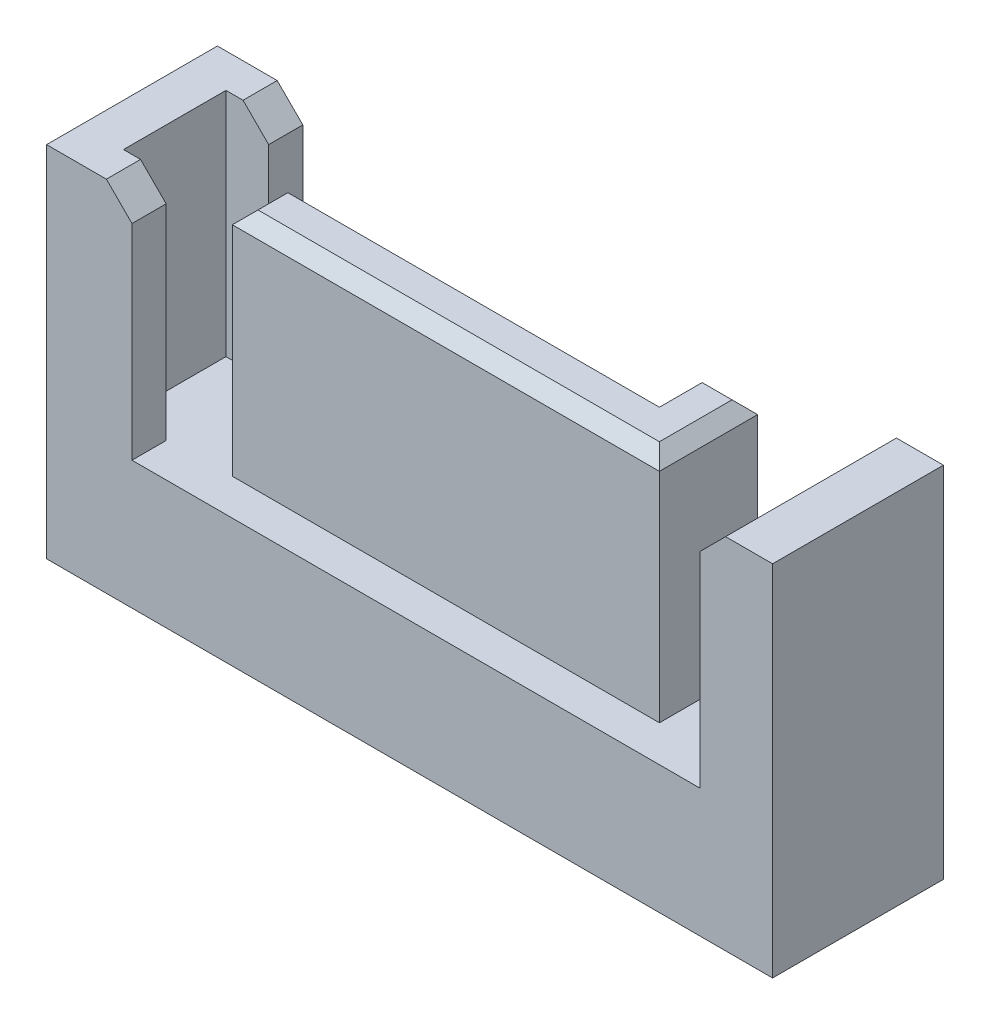
ISO-10303-21;
HEADER;
FILE_DESCRIPTION(('STEP AP214'),'2;1');
FILE_NAME('part.step','',(''),(''),'','','');
FILE_SCHEMA(('AUTOMOTIVE_DESIGN { 1 0 10303 214 1 1 1 1 }'));
ENDSEC;
DATA;
#1=APPLICATION_CONTEXT('core data for automotive mechanical design processes');
#2=APPLICATION_PROTOCOL_DEFINITION('international standard','automotive_design',2000,#1);
#3=PRODUCT_CONTEXT('',#1,'mechanical');
#4=PRODUCT('Part','Part','',(#3));
#5=PRODUCT_RELATED_PRODUCT_CATEGORY('part','',(#4));
#6=PRODUCT_DEFINITION_FORMATION('','',#4);
#7=PRODUCT_DEFINITION_CONTEXT('part definition',#1,'design');
#8=PRODUCT_DEFINITION('design','',#6,#7);
#9=PRODUCT_DEFINITION_SHAPE('','',#8);
#10=(LENGTH_UNIT() NAMED_UNIT(*) SI_UNIT(.MILLI.,.METRE.));
#11=(NAMED_UNIT(*) PLANE_ANGLE_UNIT() SI_UNIT($,.RADIAN.));
#12=(NAMED_UNIT(*) SI_UNIT($,.STERADIAN.) SOLID_ANGLE_UNIT());
#13=UNCERTAINTY_MEASURE_WITH_UNIT(LENGTH_MEASURE(1.E-05),#10,'distance_accuracy_value','');
#14=(GEOMETRIC_REPRESENTATION_CONTEXT(3) GLOBAL_UNCERTAINTY_ASSIGNED_CONTEXT((#13)) GLOBAL_UNIT_ASSIGNED_CONTEXT((#10,
#11,#12)) REPRESENTATION_CONTEXT('',''));
#15=CARTESIAN_POINT('',(0.,0.,0.));
#16=DIRECTION('',(0.,0.,1.));
#17=DIRECTION('',(1.,0.,0.));
#18=AXIS2_PLACEMENT_3D('',#15,#16,#17);
#19=CARTESIAN_POINT('',(6.8,3.,2.));
#20=DIRECTION('',(0.,-1.,0.));
#21=DIRECTION('',(0.,0.,-1.));
#22=AXIS2_PLACEMENT_3D('',#19,#20,#21);
#23=PLANE('',#22);
#24=DIRECTION('',(0.,0.,-1.));
#25=VECTOR('',#24,1.);
#26=CARTESIAN_POINT('',(6.8,3.,-2.));
#27=LINE('',#26,#25);
#28=CARTESIAN_POINT('',(6.8,3.,2.));
#29=VERTEX_POINT('',#28);
#30=CARTESIAN_POINT('',(6.8,3.,-2.));
#31=VERTEX_POINT('',#30);
#32=EDGE_CURVE('E238',#29,#31,#27,.T.);
#33=ORIENTED_EDGE('',*,*,#32,.T.);
#34=DIRECTION('',(-1.,0.,0.));
#35=VECTOR('',#34,1.);
#36=CARTESIAN_POINT('',(6.8,3.,-2.));
#37=LINE('',#36,#35);
#38=CARTESIAN_POINT('',(-6.5,3.,-2.));
#39=VERTEX_POINT('',#38);
#40=EDGE_CURVE('E241',#31,#39,#37,.T.);
#41=ORIENTED_EDGE('',*,*,#40,.T.);
#42=DIRECTION('',(0.,0.,1.));
#43=VECTOR('',#42,1.);
#44=CARTESIAN_POINT('',(-6.5,3.,-2.));
#45=LINE('',#44,#43);
#46=CARTESIAN_POINT('',(-6.5,3.,-1.2));
#47=VERTEX_POINT('',#46);
#48=EDGE_CURVE('E245',#39,#47,#45,.T.);
#49=ORIENTED_EDGE('',*,*,#48,.T.);
#50=DIRECTION('',(-1.,0.,0.));
#51=VECTOR('',#50,1.);
#52=CARTESIAN_POINT('',(-6.5,3.,-1.2));
#53=LINE('',#52,#51);
#54=CARTESIAN_POINT('',(-7.5,3.,-1.2));
#55=VERTEX_POINT('',#54);
#56=EDGE_CURVE('E248',#47,#55,#53,.T.);
#57=ORIENTED_EDGE('',*,*,#56,.T.);
#58=DIRECTION('',(0.,0.,1.));
#59=VECTOR('',#58,1.);
#60=CARTESIAN_POINT('',(-7.5,3.,-1.2));
#61=LINE('',#60,#59);
#62=CARTESIAN_POINT('',(-7.5,3.,1.2));
#63=VERTEX_POINT('',#62);
#64=EDGE_CURVE('E251',#55,#63,#61,.T.);
#65=ORIENTED_EDGE('',*,*,#64,.T.);
#66=DIRECTION('',(1.,0.,0.));
#67=VECTOR('',#66,1.);
#68=CARTESIAN_POINT('',(-6.5,3.,1.2));
#69=LINE('',#68,#67);
#70=CARTESIAN_POINT('',(-6.5,3.,1.2));
#71=VERTEX_POINT('',#70);
#72=EDGE_CURVE('E254',#63,#71,#69,.T.);
#73=ORIENTED_EDGE('',*,*,#72,.T.);
#74=DIRECTION('',(0.,0.,1.));
#75=VECTOR('',#74,1.);
#76=CARTESIAN_POINT('',(-6.5,3.,1.2));
#77=LINE('',#76,#75);
#78=CARTESIAN_POINT('',(-6.5,3.,2.));
#79=VERTEX_POINT('',#78);
#80=EDGE_CURVE('E257',#71,#79,#77,.T.);
#81=ORIENTED_EDGE('',*,*,#80,.T.);
#82=DIRECTION('',(1.,0.,0.));
#83=VECTOR('',#82,1.);
#84=CARTESIAN_POINT('',(6.8,3.,2.));
#85=LINE('',#84,#83);
#86=EDGE_CURVE('E260',#79,#29,#85,.T.);
#87=ORIENTED_EDGE('',*,*,#86,.T.);
#88=EDGE_LOOP('',(#33,#41,#49,#57,#65,#73,#81,#87));
#89=FACE_BOUND('',#88,.T.);
#90=DIRECTION('',(-1.,0.,0.));
#91=VECTOR('',#90,1.);
#92=CARTESIAN_POINT('',(3.7,3.,-1.15));
#93=LINE('',#92,#91);
#94=CARTESIAN_POINT('',(5.,3.,-1.15));
#95=VERTEX_POINT('',#94);
#96=CARTESIAN_POINT('',(3.7,3.,-1.15));
#97=VERTEX_POINT('',#96);
#98=EDGE_CURVE('E202',#95,#97,#93,.T.);
#99=ORIENTED_EDGE('',*,*,#98,.F.);
#100=DIRECTION('',(0.,0.,-1.));
#101=VECTOR('',#100,1.);
#102=CARTESIAN_POINT('',(5.,3.,-1.15));
#103=LINE('',#102,#101);
#104=CARTESIAN_POINT('',(5.,3.,1.15));
#105=VERTEX_POINT('',#104);
#106=EDGE_CURVE('E210',#105,#95,#103,.T.);
#107=ORIENTED_EDGE('',*,*,#106,.F.);
#108=DIRECTION('',(1.,0.,0.));
#109=VECTOR('',#108,1.);
#110=CARTESIAN_POINT('',(5.,3.,1.15));
#111=LINE('',#110,#109);
#112=CARTESIAN_POINT('',(-5.,3.,1.15));
#113=VERTEX_POINT('',#112);
#114=EDGE_CURVE('E222',#113,#105,#111,.T.);
#115=ORIENTED_EDGE('',*,*,#114,.F.);
#116=DIRECTION('',(0.,0.,1.));
#117=VECTOR('',#116,1.);
#118=CARTESIAN_POINT('',(-5.,3.,1.15));
#119=LINE('',#118,#117);
#120=CARTESIAN_POINT('',(-5.,3.,-0.15));
#121=VERTEX_POINT('',#120);
#122=EDGE_CURVE('E224',#121,#113,#119,.T.);
#123=ORIENTED_EDGE('',*,*,#122,.F.);
#124=DIRECTION('',(-1.,0.,0.));
#125=VECTOR('',#124,1.);
#126=CARTESIAN_POINT('',(-5.,3.,-0.15));
#127=LINE('',#126,#125);
#128=CARTESIAN_POINT('',(3.7,3.,-0.150000000000001));
#129=VERTEX_POINT('',#128);
#130=EDGE_CURVE('E404',#129,#121,#127,.T.);
#131=ORIENTED_EDGE('',*,*,#130,.F.);
#132=DIRECTION('',(0.,0.,1.));
#133=VECTOR('',#132,1.);
#134=CARTESIAN_POINT('',(3.7,3.,-0.150000000000001));
#135=LINE('',#134,#133);
#136=EDGE_CURVE('E219',#97,#129,#135,.T.);
#137=ORIENTED_EDGE('',*,*,#136,.F.);
#138=EDGE_LOOP('',(#99,#107,#115,#123,#131,#137));
#139=FACE_BOUND('',#138,.T.);
#140=ADVANCED_FACE('F37',(#89,#139),#23,.F.);
#141=CARTESIAN_POINT('',(-8.5,8.4,2.));
#142=DIRECTION('',(0.,1.,0.));
#143=DIRECTION('',(0.,0.,1.));
#144=AXIS2_PLACEMENT_3D('',#141,#142,#143);
#145=PLANE('',#144);
#146=DIRECTION('',(-1.,0.,0.));
#147=VECTOR('',#146,1.);
#148=CARTESIAN_POINT('',(-8.5,8.4,-2.));
#149=LINE('',#148,#147);
#150=CARTESIAN_POINT('',(8.5,8.4,-2.));
#151=VERTEX_POINT('',#150);
#152=CARTESIAN_POINT('',(7.4,8.4,-2.));
#153=VERTEX_POINT('',#152);
#154=EDGE_CURVE('E304',#151,#153,#149,.T.);
#155=ORIENTED_EDGE('',*,*,#154,.T.);
#156=DIRECTION('',(0.,0.,1.));
#157=VECTOR('',#156,1.);
#158=CARTESIAN_POINT('',(7.4,8.4,2.));
#159=LINE('',#158,#157);
#160=CARTESIAN_POINT('',(7.4,8.4,2.));
#161=VERTEX_POINT('',#160);
#162=EDGE_CURVE('E351',#153,#161,#159,.T.);
#163=ORIENTED_EDGE('',*,*,#162,.T.);
#164=DIRECTION('',(1.,0.,0.));
#165=VECTOR('',#164,1.);
#166=CARTESIAN_POINT('',(-8.5,8.4,2.));
#167=LINE('',#166,#165);
#168=CARTESIAN_POINT('',(8.5,8.4,2.));
#169=VERTEX_POINT('',#168);
#170=EDGE_CURVE('E296',#161,#169,#167,.T.);
#171=ORIENTED_EDGE('',*,*,#170,.T.);
#172=DIRECTION('',(0.,0.,-1.));
#173=VECTOR('',#172,1.);
#174=CARTESIAN_POINT('',(8.5,8.4,-2.));
#175=LINE('',#174,#173);
#176=EDGE_CURVE('E301',#169,#151,#175,.T.);
#177=ORIENTED_EDGE('',*,*,#176,.T.);
#178=EDGE_LOOP('',(#155,#163,#171,#177));
#179=FACE_BOUND('',#178,.T.);
#180=ADVANCED_FACE('F421',(#179),#145,.T.);
#181=CARTESIAN_POINT('',(-8.5,8.4,-2.));
#182=DIRECTION('',(1.,0.,0.));
#183=DIRECTION('',(0.,0.,-1.));
#184=AXIS2_PLACEMENT_3D('',#181,#182,#183);
#185=PLANE('',#184);
#186=DIRECTION('',(0.,0.,1.));
#187=VECTOR('',#186,1.);
#188=CARTESIAN_POINT('',(-8.5,0.,-2.));
#189=LINE('',#188,#187);
#190=CARTESIAN_POINT('',(-8.5,0.,-2.));
#191=VERTEX_POINT('',#190);
#192=CARTESIAN_POINT('',(-8.5,0.,2.));
#193=VERTEX_POINT('',#192);
#194=EDGE_CURVE('E273',#191,#193,#189,.T.);
#195=ORIENTED_EDGE('',*,*,#194,.T.);
#196=DIRECTION('',(0.,-1.,0.));
#197=VECTOR('',#196,1.);
#198=CARTESIAN_POINT('',(-8.5,8.4,2.));
#199=LINE('',#198,#197);
#200=CARTESIAN_POINT('',(-8.5,8.4,2.));
#201=VERTEX_POINT('',#200);
#202=EDGE_CURVE('E323',#201,#193,#199,.T.);
#203=ORIENTED_EDGE('',*,*,#202,.F.);
#204=DIRECTION('',(0.,0.,1.));
#205=VECTOR('',#204,1.);
#206=CARTESIAN_POINT('',(-8.5,8.4,-2.));
#207=LINE('',#206,#205);
#208=CARTESIAN_POINT('',(-8.5,8.4,-2.));
#209=VERTEX_POINT('',#208);
#210=EDGE_CURVE('E293',#209,#201,#207,.T.);
#211=ORIENTED_EDGE('',*,*,#210,.F.);
#212=DIRECTION('',(0.,-1.,0.));
#213=VECTOR('',#212,1.);
#214=CARTESIAN_POINT('',(-8.5,8.4,-2.));
#215=LINE('',#214,#213);
#216=EDGE_CURVE('E307',#209,#191,#215,.T.);
#217=ORIENTED_EDGE('',*,*,#216,.T.);
#218=EDGE_LOOP('',(#195,#203,#211,#217));
#219=FACE_BOUND('',#218,.T.);
#220=ADVANCED_FACE('F427',(#219),#185,.F.);
#221=CARTESIAN_POINT('',(-8.5,8.4,2.));
#222=DIRECTION('',(0.,0.,-1.));
#223=DIRECTION('',(-1.,0.,0.));
#224=AXIS2_PLACEMENT_3D('',#221,#222,#223);
#225=PLANE('',#224);
#226=DIRECTION('',(0.,1.,0.));
#227=VECTOR('',#226,1.);
#228=CARTESIAN_POINT('',(-6.5,3.,2.));
#229=LINE('',#228,#227);
#230=CARTESIAN_POINT('',(-6.5,7.8,2.));
#231=VERTEX_POINT('',#230);
#232=EDGE_CURVE('E274',#79,#231,#229,.T.);
#233=ORIENTED_EDGE('',*,*,#232,.T.);
#234=DIRECTION('',(-0.707106781186549,0.707106781186547,0.));
#235=VECTOR('',#234,1.);
#236=CARTESIAN_POINT('',(-6.5,7.8,2.));
#237=LINE('',#236,#235);
#238=CARTESIAN_POINT('',(-7.10000000000001,8.4,2.));
#239=VERTEX_POINT('',#238);
#240=EDGE_CURVE('E331',#231,#239,#237,.T.);
#241=ORIENTED_EDGE('',*,*,#240,.T.);
#242=EDGE_CURVE('E298',#201,#239,#167,.T.);
#243=ORIENTED_EDGE('',*,*,#242,.F.);
#244=ORIENTED_EDGE('',*,*,#202,.T.);
#245=DIRECTION('',(1.,0.,0.));
#246=VECTOR('',#245,1.);
#247=CARTESIAN_POINT('',(-8.5,0.,2.));
#248=LINE('',#247,#246);
#249=CARTESIAN_POINT('',(8.5,0.,2.));
#250=VERTEX_POINT('',#249);
#251=EDGE_CURVE('E310',#193,#250,#248,.T.);
#252=ORIENTED_EDGE('',*,*,#251,.T.);
#253=DIRECTION('',(0.,-1.,0.));
#254=VECTOR('',#253,1.);
#255=CARTESIAN_POINT('',(8.5,8.4,2.));
#256=LINE('',#255,#254);
#257=EDGE_CURVE('E320',#169,#250,#256,.T.);
#258=ORIENTED_EDGE('',*,*,#257,.F.);
#259=ORIENTED_EDGE('',*,*,#170,.F.);
#260=DIRECTION('',(-0.707106781186549,-0.707106781186547,0.));
#261=VECTOR('',#260,1.);
#262=CARTESIAN_POINT('',(6.8,7.8,2.));
#263=LINE('',#262,#261);
#264=CARTESIAN_POINT('',(6.8,7.8,2.));
#265=VERTEX_POINT('',#264);
#266=EDGE_CURVE('E329',#161,#265,#263,.T.);
#267=ORIENTED_EDGE('',*,*,#266,.T.);
#268=DIRECTION('',(0.,1.,0.));
#269=VECTOR('',#268,1.);
#270=CARTESIAN_POINT('',(6.8,3.,2.));
#271=LINE('',#270,#269);
#272=EDGE_CURVE('E270',#29,#265,#271,.T.);
#273=ORIENTED_EDGE('',*,*,#272,.F.);
#274=ORIENTED_EDGE('',*,*,#86,.F.);
#275=EDGE_LOOP('',(#233,#241,#243,#244,#252,#258,#259,#267,#273,#274));
#276=FACE_BOUND('',#275,.T.);
#277=ADVANCED_FACE('F472',(#276),#225,.F.);
#278=CARTESIAN_POINT('',(8.5,8.4,-2.));
#279=DIRECTION('',(-1.,0.,0.));
#280=DIRECTION('',(0.,0.,1.));
#281=AXIS2_PLACEMENT_3D('',#278,#279,#280);
#282=PLANE('',#281);
#283=DIRECTION('',(0.,0.,-1.));
#284=VECTOR('',#283,1.);
#285=CARTESIAN_POINT('',(8.5,0.,-2.));
#286=LINE('',#285,#284);
#287=CARTESIAN_POINT('',(8.5,0.,-2.));
#288=VERTEX_POINT('',#287);
#289=EDGE_CURVE('E312',#250,#288,#286,.T.);
#290=ORIENTED_EDGE('',*,*,#289,.T.);
#291=DIRECTION('',(0.,-1.,0.));
#292=VECTOR('',#291,1.);
#293=CARTESIAN_POINT('',(8.5,8.4,-2.));
#294=LINE('',#293,#292);
#295=EDGE_CURVE('E317',#151,#288,#294,.T.);
#296=ORIENTED_EDGE('',*,*,#295,.F.);
#297=ORIENTED_EDGE('',*,*,#176,.F.);
#298=ORIENTED_EDGE('',*,*,#257,.T.);
#299=EDGE_LOOP('',(#290,#296,#297,#298));
#300=FACE_BOUND('',#299,.T.);
#301=ADVANCED_FACE('F468',(#300),#282,.F.);
#302=CARTESIAN_POINT('',(-8.5,8.4,-2.));
#303=DIRECTION('',(0.,0.,1.));
#304=DIRECTION('',(1.,0.,0.));
#305=AXIS2_PLACEMENT_3D('',#302,#303,#304);
#306=PLANE('',#305);
#307=CARTESIAN_POINT('',(-7.10000000000001,8.4,-2.));
#308=VERTEX_POINT('',#307);
#309=EDGE_CURVE('E303',#308,#209,#149,.T.);
#310=ORIENTED_EDGE('',*,*,#309,.F.);
#311=DIRECTION('',(0.707106781186549,-0.707106781186547,0.));
#312=VECTOR('',#311,1.);
#313=CARTESIAN_POINT('',(-6.5,7.8,-2.));
#314=LINE('',#313,#312);
#315=CARTESIAN_POINT('',(-6.5,7.8,-2.));
#316=VERTEX_POINT('',#315);
#317=EDGE_CURVE('E346',#308,#316,#314,.T.);
#318=ORIENTED_EDGE('',*,*,#317,.T.);
#319=DIRECTION('',(0.,1.,0.));
#320=VECTOR('',#319,1.);
#321=CARTESIAN_POINT('',(-6.5,3.,-2.));
#322=LINE('',#321,#320);
#323=EDGE_CURVE('E288',#39,#316,#322,.T.);
#324=ORIENTED_EDGE('',*,*,#323,.F.);
#325=ORIENTED_EDGE('',*,*,#40,.F.);
#326=DIRECTION('',(0.,1.,0.));
#327=VECTOR('',#326,1.);
#328=CARTESIAN_POINT('',(6.8,3.,-2.));
#329=LINE('',#328,#327);
#330=CARTESIAN_POINT('',(6.8,7.8,-2.));
#331=VERTEX_POINT('',#330);
#332=EDGE_CURVE('E263',#31,#331,#329,.T.);
#333=ORIENTED_EDGE('',*,*,#332,.T.);
#334=DIRECTION('',(0.707106781186549,0.707106781186547,0.));
#335=VECTOR('',#334,1.);
#336=CARTESIAN_POINT('',(6.8,7.8,-2.));
#337=LINE('',#336,#335);
#338=EDGE_CURVE('E344',#331,#153,#337,.T.);
#339=ORIENTED_EDGE('',*,*,#338,.T.);
#340=ORIENTED_EDGE('',*,*,#154,.F.);
#341=ORIENTED_EDGE('',*,*,#295,.T.);
#342=DIRECTION('',(-1.,0.,0.));
#343=VECTOR('',#342,1.);
#344=CARTESIAN_POINT('',(-8.5,0.,-2.));
#345=LINE('',#344,#343);
#346=EDGE_CURVE('E297',#288,#191,#345,.T.);
#347=ORIENTED_EDGE('',*,*,#346,.T.);
#348=ORIENTED_EDGE('',*,*,#216,.F.);
#349=EDGE_LOOP('',(#310,#318,#324,#325,#333,#339,#340,#341,#347,#348));
#350=FACE_BOUND('',#349,.T.);
#351=ADVANCED_FACE('F461',(#350),#306,.F.);
#352=ORIENTED_EDGE('',*,*,#242,.T.);
#353=DIRECTION('',(0.,0.,-1.));
#354=VECTOR('',#353,1.);
#355=CARTESIAN_POINT('',(-7.10000000000001,8.4,1.2));
#356=LINE('',#355,#354);
#357=CARTESIAN_POINT('',(-7.10000000000001,8.4,1.2));
#358=VERTEX_POINT('',#357);
#359=EDGE_CURVE('E335',#239,#358,#356,.T.);
#360=ORIENTED_EDGE('',*,*,#359,.T.);
#361=DIRECTION('',(1.,0.,0.));
#362=VECTOR('',#361,1.);
#363=CARTESIAN_POINT('',(-6.5,8.4,1.2));
#364=LINE('',#363,#362);
#365=CARTESIAN_POINT('',(-7.5,8.4,1.2));
#366=VERTEX_POINT('',#365);
#367=EDGE_CURVE('E242',#366,#358,#364,.T.);
#368=ORIENTED_EDGE('',*,*,#367,.F.);
#369=DIRECTION('',(0.,0.,1.));
#370=VECTOR('',#369,1.);
#371=CARTESIAN_POINT('',(-7.5,8.4,-1.2));
#372=LINE('',#371,#370);
#373=CARTESIAN_POINT('',(-7.5,8.4,-1.2));
#374=VERTEX_POINT('',#373);
#375=EDGE_CURVE('E265',#374,#366,#372,.T.);
#376=ORIENTED_EDGE('',*,*,#375,.F.);
#377=DIRECTION('',(-1.,0.,0.));
#378=VECTOR('',#377,1.);
#379=CARTESIAN_POINT('',(-6.5,8.4,-1.2));
#380=LINE('',#379,#378);
#381=CARTESIAN_POINT('',(-7.10000000000001,8.4,-1.2));
#382=VERTEX_POINT('',#381);
#383=EDGE_CURVE('E237',#382,#374,#380,.T.);
#384=ORIENTED_EDGE('',*,*,#383,.F.);
#385=DIRECTION('',(0.,0.,-1.));
#386=VECTOR('',#385,1.);
#387=CARTESIAN_POINT('',(-7.10000000000001,8.4,-2.));
#388=LINE('',#387,#386);
#389=EDGE_CURVE('E333',#382,#308,#388,.T.);
#390=ORIENTED_EDGE('',*,*,#389,.T.);
#391=ORIENTED_EDGE('',*,*,#309,.T.);
#392=ORIENTED_EDGE('',*,*,#210,.T.);
#393=EDGE_LOOP('',(#352,#360,#368,#376,#384,#390,#391,#392));
#394=FACE_BOUND('',#393,.T.);
#395=ADVANCED_FACE('F430',(#394),#145,.T.);
#396=CARTESIAN_POINT('',(-8.5,0.,2.));
#397=DIRECTION('',(0.,1.,0.));
#398=DIRECTION('',(0.,0.,1.));
#399=AXIS2_PLACEMENT_3D('',#396,#397,#398);
#400=PLANE('',#399);
#401=ORIENTED_EDGE('',*,*,#194,.F.);
#402=ORIENTED_EDGE('',*,*,#346,.F.);
#403=ORIENTED_EDGE('',*,*,#289,.F.);
#404=ORIENTED_EDGE('',*,*,#251,.F.);
#405=EDGE_LOOP('',(#401,#402,#403,#404));
#406=FACE_BOUND('',#405,.T.);
#407=ADVANCED_FACE('F457',(#406),#400,.F.);
#408=CARTESIAN_POINT('',(6.8,3.,-2.));
#409=DIRECTION('',(1.,0.,0.));
#410=DIRECTION('',(0.,0.,-1.));
#411=AXIS2_PLACEMENT_3D('',#408,#409,#410);
#412=PLANE('',#411);
#413=ORIENTED_EDGE('',*,*,#272,.T.);
#414=DIRECTION('',(0.,0.,-1.));
#415=VECTOR('',#414,1.);
#416=CARTESIAN_POINT('',(6.8,7.8,-2.));
#417=LINE('',#416,#415);
#418=EDGE_CURVE('E348',#265,#331,#417,.T.);
#419=ORIENTED_EDGE('',*,*,#418,.T.);
#420=ORIENTED_EDGE('',*,*,#332,.F.);
#421=ORIENTED_EDGE('',*,*,#32,.F.);
#422=EDGE_LOOP('',(#413,#419,#420,#421));
#423=FACE_BOUND('',#422,.T.);
#424=ADVANCED_FACE('F438',(#423),#412,.F.);
#425=CARTESIAN_POINT('',(-6.5,3.,1.2));
#426=DIRECTION('',(-1.,0.,0.));
#427=DIRECTION('',(0.,0.,1.));
#428=AXIS2_PLACEMENT_3D('',#425,#426,#427);
#429=PLANE('',#428);
#430=DIRECTION('',(0.,1.,0.));
#431=VECTOR('',#430,1.);
#432=CARTESIAN_POINT('',(-6.5,3.,1.2));
#433=LINE('',#432,#431);
#434=CARTESIAN_POINT('',(-6.5,7.8,1.2));
#435=VERTEX_POINT('',#434);
#436=EDGE_CURVE('E277',#71,#435,#433,.T.);
#437=ORIENTED_EDGE('',*,*,#436,.T.);
#438=DIRECTION('',(0.,0.,1.));
#439=VECTOR('',#438,1.);
#440=CARTESIAN_POINT('',(-6.5,7.8,2.));
#441=LINE('',#440,#439);
#442=EDGE_CURVE('E326',#435,#231,#441,.T.);
#443=ORIENTED_EDGE('',*,*,#442,.T.);
#444=ORIENTED_EDGE('',*,*,#232,.F.);
#445=ORIENTED_EDGE('',*,*,#80,.F.);
#446=EDGE_LOOP('',(#437,#443,#444,#445));
#447=FACE_BOUND('',#446,.T.);
#448=ADVANCED_FACE('F434',(#447),#429,.F.);
#449=CARTESIAN_POINT('',(-6.5,3.,1.2));
#450=DIRECTION('',(0.,0.,1.));
#451=DIRECTION('',(1.,0.,0.));
#452=AXIS2_PLACEMENT_3D('',#449,#450,#451);
#453=PLANE('',#452);
#454=ORIENTED_EDGE('',*,*,#367,.T.);
#455=DIRECTION('',(0.707106781186549,-0.707106781186547,0.));
#456=VECTOR('',#455,1.);
#457=CARTESIAN_POINT('',(-6.5,7.8,1.2));
#458=LINE('',#457,#456);
#459=EDGE_CURVE('E337',#358,#435,#458,.T.);
#460=ORIENTED_EDGE('',*,*,#459,.T.);
#461=ORIENTED_EDGE('',*,*,#436,.F.);
#462=ORIENTED_EDGE('',*,*,#72,.F.);
#463=DIRECTION('',(0.,1.,0.));
#464=VECTOR('',#463,1.);
#465=CARTESIAN_POINT('',(-7.5,3.,1.2));
#466=LINE('',#465,#464);
#467=EDGE_CURVE('E280',#63,#366,#466,.T.);
#468=ORIENTED_EDGE('',*,*,#467,.T.);
#469=EDGE_LOOP('',(#454,#460,#461,#462,#468));
#470=FACE_BOUND('',#469,.T.);
#471=ADVANCED_FACE('F437',(#470),#453,.F.);
#472=CARTESIAN_POINT('',(-7.5,3.,-1.2));
#473=DIRECTION('',(-1.,0.,0.));
#474=DIRECTION('',(0.,0.,1.));
#475=AXIS2_PLACEMENT_3D('',#472,#473,#474);
#476=PLANE('',#475);
#477=ORIENTED_EDGE('',*,*,#375,.T.);
#478=ORIENTED_EDGE('',*,*,#467,.F.);
#479=ORIENTED_EDGE('',*,*,#64,.F.);
#480=DIRECTION('',(0.,1.,0.));
#481=VECTOR('',#480,1.);
#482=CARTESIAN_POINT('',(-7.5,3.,-1.2));
#483=LINE('',#482,#481);
#484=EDGE_CURVE('E282',#55,#374,#483,.T.);
#485=ORIENTED_EDGE('',*,*,#484,.T.);
#486=EDGE_LOOP('',(#477,#478,#479,#485));
#487=FACE_BOUND('',#486,.T.);
#488=ADVANCED_FACE('F442',(#487),#476,.F.);
#489=CARTESIAN_POINT('',(-6.5,3.,-1.2));
#490=DIRECTION('',(0.,0.,-1.));
#491=DIRECTION('',(-1.,0.,0.));
#492=AXIS2_PLACEMENT_3D('',#489,#490,#491);
#493=PLANE('',#492);
#494=DIRECTION('',(0.,1.,0.));
#495=VECTOR('',#494,1.);
#496=CARTESIAN_POINT('',(-6.5,3.,-1.2));
#497=LINE('',#496,#495);
#498=CARTESIAN_POINT('',(-6.5,7.8,-1.2));
#499=VERTEX_POINT('',#498);
#500=EDGE_CURVE('E285',#47,#499,#497,.T.);
#501=ORIENTED_EDGE('',*,*,#500,.T.);
#502=DIRECTION('',(-0.707106781186549,0.707106781186547,0.));
#503=VECTOR('',#502,1.);
#504=CARTESIAN_POINT('',(-6.5,7.8,-1.2));
#505=LINE('',#504,#503);
#506=EDGE_CURVE('E342',#499,#382,#505,.T.);
#507=ORIENTED_EDGE('',*,*,#506,.T.);
#508=ORIENTED_EDGE('',*,*,#383,.T.);
#509=ORIENTED_EDGE('',*,*,#484,.F.);
#510=ORIENTED_EDGE('',*,*,#56,.F.);
#511=EDGE_LOOP('',(#501,#507,#508,#509,#510));
#512=FACE_BOUND('',#511,.T.);
#513=ADVANCED_FACE('F446',(#512),#493,.F.);
#514=CARTESIAN_POINT('',(-6.5,3.,-2.));
#515=DIRECTION('',(-1.,0.,0.));
#516=DIRECTION('',(0.,0.,1.));
#517=AXIS2_PLACEMENT_3D('',#514,#515,#516);
#518=PLANE('',#517);
#519=ORIENTED_EDGE('',*,*,#323,.T.);
#520=DIRECTION('',(0.,0.,1.));
#521=VECTOR('',#520,1.);
#522=CARTESIAN_POINT('',(-6.5,7.8,-1.2));
#523=LINE('',#522,#521);
#524=EDGE_CURVE('E339',#316,#499,#523,.T.);
#525=ORIENTED_EDGE('',*,*,#524,.T.);
#526=ORIENTED_EDGE('',*,*,#500,.F.);
#527=ORIENTED_EDGE('',*,*,#48,.F.);
#528=EDGE_LOOP('',(#519,#525,#526,#527));
#529=FACE_BOUND('',#528,.T.);
#530=ADVANCED_FACE('F450',(#529),#518,.F.);
#531=CARTESIAN_POINT('',(-6.5,7.8,1.2));
#532=DIRECTION('',(0.707106781186547,0.707106781186549,0.));
#533=DIRECTION('',(-0.707106781186549,0.707106781186547,0.));
#534=AXIS2_PLACEMENT_3D('',#531,#532,#533);
#535=PLANE('',#534);
#536=ORIENTED_EDGE('',*,*,#459,.F.);
#537=ORIENTED_EDGE('',*,*,#359,.F.);
#538=ORIENTED_EDGE('',*,*,#240,.F.);
#539=ORIENTED_EDGE('',*,*,#442,.F.);
#540=EDGE_LOOP('',(#536,#537,#538,#539));
#541=FACE_BOUND('',#540,.T.);
#542=ADVANCED_FACE('F454',(#541),#535,.T.);
#543=CARTESIAN_POINT('',(-6.5,7.8,-2.));
#544=DIRECTION('',(0.707106781186547,0.707106781186549,0.));
#545=DIRECTION('',(-0.707106781186549,0.707106781186547,0.));
#546=AXIS2_PLACEMENT_3D('',#543,#544,#545);
#547=PLANE('',#546);
#548=ORIENTED_EDGE('',*,*,#317,.F.);
#549=ORIENTED_EDGE('',*,*,#389,.F.);
#550=ORIENTED_EDGE('',*,*,#506,.F.);
#551=ORIENTED_EDGE('',*,*,#524,.F.);
#552=EDGE_LOOP('',(#548,#549,#550,#551));
#553=FACE_BOUND('',#552,.T.);
#554=ADVANCED_FACE('F482',(#553),#547,.T.);
#555=CARTESIAN_POINT('',(6.8,7.8,-2.));
#556=DIRECTION('',(-0.707106781186547,0.707106781186549,0.));
#557=DIRECTION('',(-0.707106781186549,-0.707106781186547,0.));
#558=AXIS2_PLACEMENT_3D('',#555,#556,#557);
#559=PLANE('',#558);
#560=ORIENTED_EDGE('',*,*,#266,.F.);
#561=ORIENTED_EDGE('',*,*,#162,.F.);
#562=ORIENTED_EDGE('',*,*,#338,.F.);
#563=ORIENTED_EDGE('',*,*,#418,.F.);
#564=EDGE_LOOP('',(#560,#561,#562,#563));
#565=FACE_BOUND('',#564,.T.);
#566=ADVANCED_FACE('F486',(#565),#559,.T.);
#567=CARTESIAN_POINT('',(3.7,8.4,-1.15));
#568=DIRECTION('',(0.,0.,1.));
#569=DIRECTION('',(1.,0.,0.));
#570=AXIS2_PLACEMENT_3D('',#567,#568,#569);
#571=PLANE('',#570);
#572=DIRECTION('',(0.,-1.,0.));
#573=VECTOR('',#572,1.);
#574=CARTESIAN_POINT('',(3.7,8.4,-1.15));
#575=LINE('',#574,#573);
#576=CARTESIAN_POINT('',(3.7,8.1,-1.15));
#577=VERTEX_POINT('',#576);
#578=EDGE_CURVE('E235',#577,#97,#575,.T.);
#579=ORIENTED_EDGE('',*,*,#578,.F.);
#580=DIRECTION('',(1.,0.,0.));
#581=VECTOR('',#580,1.);
#582=CARTESIAN_POINT('',(3.7,8.1,-1.15));
#583=LINE('',#582,#581);
#584=CARTESIAN_POINT('',(5.,8.1,-1.15));
#585=VERTEX_POINT('',#584);
#586=EDGE_CURVE('E204',#577,#585,#583,.T.);
#587=ORIENTED_EDGE('',*,*,#586,.T.);
#588=DIRECTION('',(0.,-1.,0.));
#589=VECTOR('',#588,1.);
#590=CARTESIAN_POINT('',(5.,8.4,-1.15));
#591=LINE('',#590,#589);
#592=EDGE_CURVE('E198',#585,#95,#591,.T.);
#593=ORIENTED_EDGE('',*,*,#592,.T.);
#594=ORIENTED_EDGE('',*,*,#98,.T.);
#595=EDGE_LOOP('',(#579,#587,#593,#594));
#596=FACE_BOUND('',#595,.T.);
#597=ADVANCED_FACE('F201',(#596),#571,.F.);
#598=CARTESIAN_POINT('',(3.7,8.4,-0.150000000000001));
#599=DIRECTION('',(1.,0.,0.));
#600=DIRECTION('',(0.,0.,-1.));
#601=AXIS2_PLACEMENT_3D('',#598,#599,#600);
#602=PLANE('',#601);
#603=DIRECTION('',(0.,-1.,0.));
#604=VECTOR('',#603,1.);
#605=CARTESIAN_POINT('',(3.7,8.4,-0.150000000000001));
#606=LINE('',#605,#604);
#607=CARTESIAN_POINT('',(3.7,8.1,-0.150000000000001));
#608=VERTEX_POINT('',#607);
#609=EDGE_CURVE('E233',#608,#129,#606,.T.);
#610=ORIENTED_EDGE('',*,*,#609,.F.);
#611=DIRECTION('',(0.,0.,-1.));
#612=VECTOR('',#611,1.);
#613=CARTESIAN_POINT('',(3.7,8.1,-0.150000000000001));
#614=LINE('',#613,#612);
#615=EDGE_CURVE('E369',#608,#577,#614,.T.);
#616=ORIENTED_EDGE('',*,*,#615,.T.);
#617=ORIENTED_EDGE('',*,*,#578,.T.);
#618=ORIENTED_EDGE('',*,*,#136,.T.);
#619=EDGE_LOOP('',(#610,#616,#617,#618));
#620=FACE_BOUND('',#619,.T.);
#621=ADVANCED_FACE('F403',(#620),#602,.F.);
#622=CARTESIAN_POINT('',(-5.,8.4,-0.15));
#623=DIRECTION('',(0.,0.,1.));
#624=DIRECTION('',(1.,0.,0.));
#625=AXIS2_PLACEMENT_3D('',#622,#623,#624);
#626=PLANE('',#625);
#627=DIRECTION('',(0.,-1.,0.));
#628=VECTOR('',#627,1.);
#629=CARTESIAN_POINT('',(-5.,8.4,-0.15));
#630=LINE('',#629,#628);
#631=CARTESIAN_POINT('',(-5.,8.1,-0.15));
#632=VERTEX_POINT('',#631);
#633=EDGE_CURVE('E231',#632,#121,#630,.T.);
#634=ORIENTED_EDGE('',*,*,#633,.F.);
#635=DIRECTION('',(1.,0.,0.));
#636=VECTOR('',#635,1.);
#637=CARTESIAN_POINT('',(-5.,8.1,-0.15));
#638=LINE('',#637,#636);
#639=EDGE_CURVE('E371',#632,#608,#638,.T.);
#640=ORIENTED_EDGE('',*,*,#639,.T.);
#641=ORIENTED_EDGE('',*,*,#609,.T.);
#642=ORIENTED_EDGE('',*,*,#130,.T.);
#643=EDGE_LOOP('',(#634,#640,#641,#642));
#644=FACE_BOUND('',#643,.T.);
#645=ADVANCED_FACE('F400',(#644),#626,.F.);
#646=CARTESIAN_POINT('',(-5.,8.4,1.15));
#647=DIRECTION('',(1.,0.,0.));
#648=DIRECTION('',(0.,0.,-1.));
#649=AXIS2_PLACEMENT_3D('',#646,#647,#648);
#650=PLANE('',#649);
#651=DIRECTION('',(0.,-1.,0.));
#652=VECTOR('',#651,1.);
#653=CARTESIAN_POINT('',(-5.,8.4,1.15));
#654=LINE('',#653,#652);
#655=CARTESIAN_POINT('',(-5.,8.1,1.15));
#656=VERTEX_POINT('',#655);
#657=EDGE_CURVE('E229',#656,#113,#654,.T.);
#658=ORIENTED_EDGE('',*,*,#657,.F.);
#659=DIRECTION('',(0.,0.,-1.));
#660=VECTOR('',#659,1.);
#661=CARTESIAN_POINT('',(-5.,8.1,1.15));
#662=LINE('',#661,#660);
#663=EDGE_CURVE('E46',#656,#632,#662,.T.);
#664=ORIENTED_EDGE('',*,*,#663,.T.);
#665=ORIENTED_EDGE('',*,*,#633,.T.);
#666=ORIENTED_EDGE('',*,*,#122,.T.);
#667=EDGE_LOOP('',(#658,#664,#665,#666));
#668=FACE_BOUND('',#667,.T.);
#669=ADVANCED_FACE('F409',(#668),#650,.F.);
#670=CARTESIAN_POINT('',(5.,8.4,1.15));
#671=DIRECTION('',(0.,0.,-1.));
#672=DIRECTION('',(-1.,0.,0.));
#673=AXIS2_PLACEMENT_3D('',#670,#671,#672);
#674=PLANE('',#673);
#675=DIRECTION('',(0.,-1.,0.));
#676=VECTOR('',#675,1.);
#677=CARTESIAN_POINT('',(5.,8.4,1.15));
#678=LINE('',#677,#676);
#679=CARTESIAN_POINT('',(5.,8.1,1.15));
#680=VERTEX_POINT('',#679);
#681=EDGE_CURVE('E209',#680,#105,#678,.T.);
#682=ORIENTED_EDGE('',*,*,#681,.F.);
#683=DIRECTION('',(-1.,0.,0.));
#684=VECTOR('',#683,1.);
#685=CARTESIAN_POINT('',(5.,8.1,1.15));
#686=LINE('',#685,#684);
#687=EDGE_CURVE('E11',#680,#656,#686,.T.);
#688=ORIENTED_EDGE('',*,*,#687,.T.);
#689=ORIENTED_EDGE('',*,*,#657,.T.);
#690=ORIENTED_EDGE('',*,*,#114,.T.);
#691=EDGE_LOOP('',(#682,#688,#689,#690));
#692=FACE_BOUND('',#691,.T.);
#693=ADVANCED_FACE('F410',(#692),#674,.F.);
#694=CARTESIAN_POINT('',(5.,8.4,-1.15));
#695=DIRECTION('',(-1.,0.,0.));
#696=DIRECTION('',(0.,0.,1.));
#697=AXIS2_PLACEMENT_3D('',#694,#695,#696);
#698=PLANE('',#697);
#699=ORIENTED_EDGE('',*,*,#592,.F.);
#700=DIRECTION('',(0.,0.,1.));
#701=VECTOR('',#700,1.);
#702=CARTESIAN_POINT('',(5.,8.1,-1.15));
#703=LINE('',#702,#701);
#704=EDGE_CURVE('E366',#585,#680,#703,.T.);
#705=ORIENTED_EDGE('',*,*,#704,.T.);
#706=ORIENTED_EDGE('',*,*,#681,.T.);
#707=ORIENTED_EDGE('',*,*,#106,.T.);
#708=EDGE_LOOP('',(#699,#705,#706,#707));
#709=FACE_BOUND('',#708,.T.);
#710=ADVANCED_FACE('F221',(#709),#698,.F.);
#711=CARTESIAN_POINT('',(5.,8.4,-1.15));
#712=DIRECTION('',(0.,-1.,0.));
#713=DIRECTION('',(0.,0.,-1.));
#714=AXIS2_PLACEMENT_3D('',#711,#712,#713);
#715=PLANE('',#714);
#716=DIRECTION('',(1.,0.,0.));
#717=VECTOR('',#716,1.);
#718=CARTESIAN_POINT('',(5.,8.4,0.85));
#719=LINE('',#718,#717);
#720=CARTESIAN_POINT('',(-4.7,8.4,0.85));
#721=VERTEX_POINT('',#720);
#722=CARTESIAN_POINT('',(4.7,8.4,0.85));
#723=VERTEX_POINT('',#722);
#724=EDGE_CURVE('E353',#721,#723,#719,.T.);
#725=ORIENTED_EDGE('',*,*,#724,.T.);
#726=DIRECTION('',(0.,0.,-1.));
#727=VECTOR('',#726,1.);
#728=CARTESIAN_POINT('',(4.7,8.4,-1.15));
#729=LINE('',#728,#727);
#730=CARTESIAN_POINT('',(4.7,8.4,-0.85));
#731=VERTEX_POINT('',#730);
#732=EDGE_CURVE('E363',#723,#731,#729,.T.);
#733=ORIENTED_EDGE('',*,*,#732,.T.);
#734=DIRECTION('',(-1.,0.,0.));
#735=VECTOR('',#734,1.);
#736=CARTESIAN_POINT('',(5.,8.4,-0.85));
#737=LINE('',#736,#735);
#738=CARTESIAN_POINT('',(4.,8.4,-0.85));
#739=VERTEX_POINT('',#738);
#740=EDGE_CURVE('E361',#731,#739,#737,.T.);
#741=ORIENTED_EDGE('',*,*,#740,.T.);
#742=DIRECTION('',(0.,0.,1.));
#743=VECTOR('',#742,1.);
#744=CARTESIAN_POINT('',(4.,8.4,-1.15));
#745=LINE('',#744,#743);
#746=CARTESIAN_POINT('',(4.,8.4,0.149999999999999));
#747=VERTEX_POINT('',#746);
#748=EDGE_CURVE('E359',#739,#747,#745,.T.);
#749=ORIENTED_EDGE('',*,*,#748,.T.);
#750=DIRECTION('',(-1.,0.,0.));
#751=VECTOR('',#750,1.);
#752=CARTESIAN_POINT('',(5.,8.4,0.149999999999998));
#753=LINE('',#752,#751);
#754=CARTESIAN_POINT('',(-4.7,8.4,0.15));
#755=VERTEX_POINT('',#754);
#756=EDGE_CURVE('E357',#747,#755,#753,.T.);
#757=ORIENTED_EDGE('',*,*,#756,.T.);
#758=DIRECTION('',(0.,0.,1.));
#759=VECTOR('',#758,1.);
#760=CARTESIAN_POINT('',(-4.7,8.4,-1.15));
#761=LINE('',#760,#759);
#762=EDGE_CURVE('E355',#755,#721,#761,.T.);
#763=ORIENTED_EDGE('',*,*,#762,.T.);
#764=EDGE_LOOP('',(#725,#733,#741,#749,#757,#763));
#765=FACE_BOUND('',#764,.T.);
#766=ADVANCED_FACE('F417',(#765),#715,.F.);
#767=CARTESIAN_POINT('',(5.,8.4,0.149999999999998));
#768=DIRECTION('',(0.,-0.707106781186545,0.70710678118655));
#769=DIRECTION('',(0.,-0.70710678118655,-0.707106781186545));
#770=AXIS2_PLACEMENT_3D('',#767,#768,#769);
#771=PLANE('',#770);
#772=DIRECTION('',(-0.577350269189623,-0.577350269189629,-0.577350269189625));
#773=VECTOR('',#772,1.);
#774=CARTESIAN_POINT('',(3.56666666666667,7.96666666666667,-0.283333333333333));
#775=LINE('',#774,#773);
#776=EDGE_CURVE('E383',#608,#747,#775,.F.);
#777=ORIENTED_EDGE('',*,*,#776,.F.);
#778=ORIENTED_EDGE('',*,*,#639,.F.);
#779=DIRECTION('',(-0.577350269189625,-0.577350269189628,-0.577350269189624));
#780=VECTOR('',#779,1.);
#781=CARTESIAN_POINT('',(-5.13333333333333,7.96666666666667,-0.283333333333331));
#782=LINE('',#781,#780);
#783=EDGE_CURVE('E41',#755,#632,#782,.T.);
#784=ORIENTED_EDGE('',*,*,#783,.F.);
#785=ORIENTED_EDGE('',*,*,#756,.F.);
#786=EDGE_LOOP('',(#777,#778,#784,#785));
#787=FACE_BOUND('',#786,.T.);
#788=ADVANCED_FACE('F39',(#787),#771,.F.);
#789=CARTESIAN_POINT('',(-4.7,8.4,-1.15));
#790=DIRECTION('',(0.70710678118655,-0.707106781186546,0.));
#791=DIRECTION('',(0.707106781186546,0.70710678118655,0.));
#792=AXIS2_PLACEMENT_3D('',#789,#790,#791);
#793=PLANE('',#792);
#794=ORIENTED_EDGE('',*,*,#783,.T.);
#795=ORIENTED_EDGE('',*,*,#663,.F.);
#796=DIRECTION('',(-0.577350269189625,-0.577350269189628,0.577350269189625));
#797=VECTOR('',#796,1.);
#798=CARTESIAN_POINT('',(-1.46666666666668,11.6333333333333,-2.38333333333332));
#799=LINE('',#798,#797);
#800=EDGE_CURVE('E381',#721,#656,#799,.T.);
#801=ORIENTED_EDGE('',*,*,#800,.F.);
#802=ORIENTED_EDGE('',*,*,#762,.F.);
#803=EDGE_LOOP('',(#794,#795,#801,#802));
#804=FACE_BOUND('',#803,.T.);
#805=ADVANCED_FACE('F393',(#804),#793,.F.);
#806=CARTESIAN_POINT('',(4.,8.4,-1.15));
#807=DIRECTION('',(0.707106781186551,-0.707106781186544,0.));
#808=DIRECTION('',(0.707106781186544,0.707106781186551,0.));
#809=AXIS2_PLACEMENT_3D('',#806,#807,#808);
#810=PLANE('',#809);
#811=ORIENTED_EDGE('',*,*,#776,.T.);
#812=ORIENTED_EDGE('',*,*,#748,.F.);
#813=DIRECTION('',(-0.577350269189623,-0.577350269189629,-0.577350269189625));
#814=VECTOR('',#813,1.);
#815=CARTESIAN_POINT('',(3.9,8.3,-0.95));
#816=LINE('',#815,#814);
#817=EDGE_CURVE('E378',#577,#739,#816,.F.);
#818=ORIENTED_EDGE('',*,*,#817,.F.);
#819=ORIENTED_EDGE('',*,*,#615,.F.);
#820=EDGE_LOOP('',(#811,#812,#818,#819));
#821=FACE_BOUND('',#820,.T.);
#822=ADVANCED_FACE('F502',(#821),#810,.F.);
#823=CARTESIAN_POINT('',(5.,8.4,0.85));
#824=DIRECTION('',(0.,-0.707106781186546,-0.70710678118655));
#825=DIRECTION('',(0.,0.70710678118655,-0.707106781186546));
#826=AXIS2_PLACEMENT_3D('',#823,#824,#825);
#827=PLANE('',#826);
#828=ORIENTED_EDGE('',*,*,#800,.T.);
#829=ORIENTED_EDGE('',*,*,#687,.F.);
#830=DIRECTION('',(-0.577350269189625,0.577350269189628,-0.577350269189625));
#831=VECTOR('',#830,1.);
#832=CARTESIAN_POINT('',(4.8,8.3,0.95));
#833=LINE('',#832,#831);
#834=EDGE_CURVE('E376',#723,#680,#833,.F.);
#835=ORIENTED_EDGE('',*,*,#834,.F.);
#836=ORIENTED_EDGE('',*,*,#724,.F.);
#837=EDGE_LOOP('',(#828,#829,#835,#836));
#838=FACE_BOUND('',#837,.T.);
#839=ADVANCED_FACE('F498',(#838),#827,.F.);
#840=CARTESIAN_POINT('',(5.,8.4,-0.85));
#841=DIRECTION('',(0.,-0.707106781186545,0.70710678118655));
#842=DIRECTION('',(0.,-0.70710678118655,-0.707106781186545));
#843=AXIS2_PLACEMENT_3D('',#840,#841,#842);
#844=PLANE('',#843);
#845=ORIENTED_EDGE('',*,*,#817,.T.);
#846=ORIENTED_EDGE('',*,*,#740,.F.);
#847=DIRECTION('',(0.577350269189625,-0.577350269189628,-0.577350269189625));
#848=VECTOR('',#847,1.);
#849=CARTESIAN_POINT('',(4.8,8.3,-0.95));
#850=LINE('',#849,#848);
#851=EDGE_CURVE('E374',#585,#731,#850,.F.);
#852=ORIENTED_EDGE('',*,*,#851,.F.);
#853=ORIENTED_EDGE('',*,*,#586,.F.);
#854=EDGE_LOOP('',(#845,#846,#852,#853));
#855=FACE_BOUND('',#854,.T.);
#856=ADVANCED_FACE('F494',(#855),#844,.F.);
#857=CARTESIAN_POINT('',(4.7,8.4,-1.15));
#858=DIRECTION('',(-0.70710678118655,-0.707106781186546,0.));
#859=DIRECTION('',(0.707106781186546,-0.70710678118655,0.));
#860=AXIS2_PLACEMENT_3D('',#857,#858,#859);
#861=PLANE('',#860);
#862=ORIENTED_EDGE('',*,*,#834,.T.);
#863=ORIENTED_EDGE('',*,*,#704,.F.);
#864=ORIENTED_EDGE('',*,*,#851,.T.);
#865=ORIENTED_EDGE('',*,*,#732,.F.);
#866=EDGE_LOOP('',(#862,#863,#864,#865));
#867=FACE_BOUND('',#866,.T.);
#868=ADVANCED_FACE('F491',(#867),#861,.F.);
#869=CLOSED_SHELL('',(#140,#180,#220,#277,#301,#351,#395,#407,#424,#448,#471,#488,#513,#530,
#542,#554,#566,#597,#621,#645,#669,#693,#710,#766,#788,#805,#822,#839,#856,#868));
#870=MANIFOLD_SOLID_BREP('B2',#869);
#871=ADVANCED_BREP_SHAPE_REPRESENTATION('',(#18,#870),#14);
#872=SHAPE_DEFINITION_REPRESENTATION(#9,#871);
ENDSEC;
END-ISO-10303-21;
